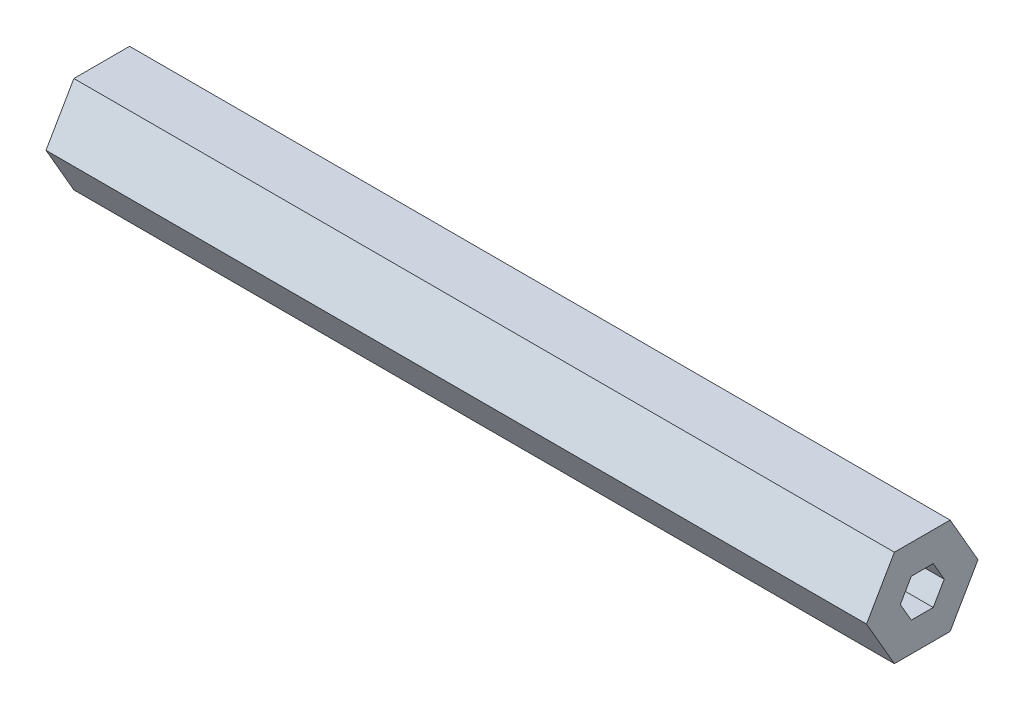
ISO-10303-21;
HEADER;
FILE_DESCRIPTION(('STEP AP214'),'2;1');
FILE_NAME('part.step','',(''),(''),'','','');
FILE_SCHEMA(('AUTOMOTIVE_DESIGN { 1 0 10303 214 1 1 1 1 }'));
ENDSEC;
DATA;
#1=APPLICATION_CONTEXT('core data for automotive mechanical design processes');
#2=APPLICATION_PROTOCOL_DEFINITION('international standard','automotive_design',2000,#1);
#3=PRODUCT_CONTEXT('',#1,'mechanical');
#4=PRODUCT('Part','Part','',(#3));
#5=PRODUCT_RELATED_PRODUCT_CATEGORY('part','',(#4));
#6=PRODUCT_DEFINITION_FORMATION('','',#4);
#7=PRODUCT_DEFINITION_CONTEXT('part definition',#1,'design');
#8=PRODUCT_DEFINITION('design','',#6,#7);
#9=PRODUCT_DEFINITION_SHAPE('','',#8);
#10=(LENGTH_UNIT() NAMED_UNIT(*) SI_UNIT(.MILLI.,.METRE.));
#11=(NAMED_UNIT(*) PLANE_ANGLE_UNIT() SI_UNIT($,.RADIAN.));
#12=(NAMED_UNIT(*) SI_UNIT($,.STERADIAN.) SOLID_ANGLE_UNIT());
#13=UNCERTAINTY_MEASURE_WITH_UNIT(LENGTH_MEASURE(1.E-05),#10,'distance_accuracy_value','');
#14=(GEOMETRIC_REPRESENTATION_CONTEXT(3) GLOBAL_UNCERTAINTY_ASSIGNED_CONTEXT((#13)) GLOBAL_UNIT_ASSIGNED_CONTEXT((#10,
#11,#12)) REPRESENTATION_CONTEXT('',''));
#15=CARTESIAN_POINT('',(0.,0.,0.));
#16=DIRECTION('',(0.,0.,1.));
#17=DIRECTION('',(1.,0.,0.));
#18=AXIS2_PLACEMENT_3D('',#15,#16,#17);
#19=CARTESIAN_POINT('',(107.95,0.,0.));
#20=DIRECTION('',(1.,0.,0.));
#21=DIRECTION('',(0.,0.,-1.));
#22=AXIS2_PLACEMENT_3D('',#19,#20,#21);
#23=PLANE('',#22);
#24=DIRECTION('',(0.,0.866025403784441,-0.499999999999995));
#25=VECTOR('',#24,1.);
#26=CARTESIAN_POINT('',(107.95,-6.34999999999996,-3.6661742093542));
#27=LINE('',#26,#25);
#28=CARTESIAN_POINT('',(107.95,-6.34999999999996,-3.6661742093542));
#29=VERTEX_POINT('',#28);
#30=CARTESIAN_POINT('',(107.95,0.,-7.33234841870825));
#31=VERTEX_POINT('',#30);
#32=EDGE_CURVE('E187',#29,#31,#27,.T.);
#33=ORIENTED_EDGE('',*,*,#32,.T.);
#34=DIRECTION('',(0.,0.866025403784438,0.500000000000001));
#35=VECTOR('',#34,1.);
#36=CARTESIAN_POINT('',(107.95,0.,-7.33234841870825));
#37=LINE('',#36,#35);
#38=CARTESIAN_POINT('',(107.95,6.35000000000001,-3.66617420935411));
#39=VERTEX_POINT('',#38);
#40=EDGE_CURVE('E190',#31,#39,#37,.T.);
#41=ORIENTED_EDGE('',*,*,#40,.T.);
#42=DIRECTION('',(0.,0.,1.));
#43=VECTOR('',#42,1.);
#44=CARTESIAN_POINT('',(107.95,6.35000000000001,-3.66617420935411));
#45=LINE('',#44,#43);
#46=CARTESIAN_POINT('',(107.95,6.34999999999999,3.66617420935416));
#47=VERTEX_POINT('',#46);
#48=EDGE_CURVE('E193',#39,#47,#45,.T.);
#49=ORIENTED_EDGE('',*,*,#48,.T.);
#50=DIRECTION('',(0.,-0.866025403784442,0.499999999999995));
#51=VECTOR('',#50,1.);
#52=CARTESIAN_POINT('',(107.95,6.34999999999999,3.66617420935416));
#53=LINE('',#52,#51);
#54=CARTESIAN_POINT('',(107.95,0.,7.33234841870825));
#55=VERTEX_POINT('',#54);
#56=EDGE_CURVE('E195',#47,#55,#53,.T.);
#57=ORIENTED_EDGE('',*,*,#56,.T.);
#58=DIRECTION('',(0.,-0.866025403784435,-0.500000000000007));
#59=VECTOR('',#58,1.);
#60=CARTESIAN_POINT('',(107.95,0.,7.33234841870825));
#61=LINE('',#60,#59);
#62=CARTESIAN_POINT('',(107.95,-6.35000000000004,3.66617420935407));
#63=VERTEX_POINT('',#62);
#64=EDGE_CURVE('E197',#55,#63,#61,.T.);
#65=ORIENTED_EDGE('',*,*,#64,.T.);
#66=DIRECTION('',(0.,0.,-1.));
#67=VECTOR('',#66,1.);
#68=CARTESIAN_POINT('',(107.95,-6.35000000000004,3.66617420935407));
#69=LINE('',#68,#67);
#70=EDGE_CURVE('E199',#63,#29,#69,.T.);
#71=ORIENTED_EDGE('',*,*,#70,.T.);
#72=EDGE_LOOP('',(#33,#41,#49,#57,#65,#71));
#73=FACE_BOUND('',#72,.T.);
#74=DIRECTION('',(0.,0.866025403784438,0.5));
#75=VECTOR('',#74,1.);
#76=CARTESIAN_POINT('',(107.95,0.,-2.88675134594813));
#77=LINE('',#76,#75);
#78=CARTESIAN_POINT('',(107.95,0.,-2.88675134594813));
#79=VERTEX_POINT('',#78);
#80=CARTESIAN_POINT('',(107.95,2.5,-1.44337567297406));
#81=VERTEX_POINT('',#80);
#82=EDGE_CURVE('E141',#79,#81,#77,.T.);
#83=ORIENTED_EDGE('',*,*,#82,.F.);
#84=DIRECTION('',(0.,0.866025403784439,-0.5));
#85=VECTOR('',#84,1.);
#86=CARTESIAN_POINT('',(107.95,-2.5,-1.44337567297407));
#87=LINE('',#86,#85);
#88=CARTESIAN_POINT('',(107.95,-2.5,-1.44337567297407));
#89=VERTEX_POINT('',#88);
#90=EDGE_CURVE('E133',#89,#79,#87,.T.);
#91=ORIENTED_EDGE('',*,*,#90,.F.);
#92=DIRECTION('',(0.,0.,-1.));
#93=VECTOR('',#92,1.);
#94=CARTESIAN_POINT('',(107.95,-2.5,1.44337567297406));
#95=LINE('',#94,#93);
#96=CARTESIAN_POINT('',(107.95,-2.5,1.44337567297406));
#97=VERTEX_POINT('',#96);
#98=EDGE_CURVE('E163',#97,#89,#95,.T.);
#99=ORIENTED_EDGE('',*,*,#98,.F.);
#100=DIRECTION('',(0.,-0.866025403784438,-0.5));
#101=VECTOR('',#100,1.);
#102=CARTESIAN_POINT('',(107.95,0.,2.88675134594813));
#103=LINE('',#102,#101);
#104=CARTESIAN_POINT('',(107.95,0.,2.88675134594813));
#105=VERTEX_POINT('',#104);
#106=EDGE_CURVE('E161',#105,#97,#103,.T.);
#107=ORIENTED_EDGE('',*,*,#106,.F.);
#108=DIRECTION('',(0.,-0.866025403784439,0.5));
#109=VECTOR('',#108,1.);
#110=CARTESIAN_POINT('',(107.95,2.5,1.44337567297406));
#111=LINE('',#110,#109);
#112=CARTESIAN_POINT('',(107.95,2.5,1.44337567297406));
#113=VERTEX_POINT('',#112);
#114=EDGE_CURVE('E157',#113,#105,#111,.T.);
#115=ORIENTED_EDGE('',*,*,#114,.F.);
#116=DIRECTION('',(0.,0.,1.));
#117=VECTOR('',#116,1.);
#118=CARTESIAN_POINT('',(107.95,2.5,-1.44337567297406));
#119=LINE('',#118,#117);
#120=EDGE_CURVE('E155',#81,#113,#119,.T.);
#121=ORIENTED_EDGE('',*,*,#120,.F.);
#122=EDGE_LOOP('',(#83,#91,#99,#107,#115,#121));
#123=FACE_BOUND('',#122,.T.);
#124=ADVANCED_FACE('F43',(#73,#123),#23,.T.);
#125=CARTESIAN_POINT('',(0.,0.,0.));
#126=DIRECTION('',(1.,0.,0.));
#127=DIRECTION('',(0.,0.,-1.));
#128=AXIS2_PLACEMENT_3D('',#125,#126,#127);
#129=PLANE('',#128);
#130=DIRECTION('',(0.,0.866025403784441,-0.499999999999995));
#131=VECTOR('',#130,1.);
#132=CARTESIAN_POINT('',(0.,-6.34999999999996,-3.6661742093542));
#133=LINE('',#132,#131);
#134=CARTESIAN_POINT('',(0.,-6.34999999999996,-3.6661742093542));
#135=VERTEX_POINT('',#134);
#136=CARTESIAN_POINT('',(0.,0.,-7.33234841870825));
#137=VERTEX_POINT('',#136);
#138=EDGE_CURVE('E150',#135,#137,#133,.T.);
#139=ORIENTED_EDGE('',*,*,#138,.F.);
#140=DIRECTION('',(0.,0.,-1.));
#141=VECTOR('',#140,1.);
#142=CARTESIAN_POINT('',(0.,-6.35000000000004,3.66617420935407));
#143=LINE('',#142,#141);
#144=CARTESIAN_POINT('',(0.,-6.35000000000004,3.66617420935407));
#145=VERTEX_POINT('',#144);
#146=EDGE_CURVE('E191',#145,#135,#143,.T.);
#147=ORIENTED_EDGE('',*,*,#146,.F.);
#148=DIRECTION('',(0.,-0.866025403784435,-0.500000000000007));
#149=VECTOR('',#148,1.);
#150=CARTESIAN_POINT('',(0.,0.,7.33234841870825));
#151=LINE('',#150,#149);
#152=CARTESIAN_POINT('',(0.,0.,7.33234841870825));
#153=VERTEX_POINT('',#152);
#154=EDGE_CURVE('E210',#153,#145,#151,.T.);
#155=ORIENTED_EDGE('',*,*,#154,.F.);
#156=DIRECTION('',(0.,-0.866025403784442,0.499999999999995));
#157=VECTOR('',#156,1.);
#158=CARTESIAN_POINT('',(0.,6.34999999999999,3.66617420935416));
#159=LINE('',#158,#157);
#160=CARTESIAN_POINT('',(0.,6.34999999999999,3.66617420935416));
#161=VERTEX_POINT('',#160);
#162=EDGE_CURVE('E208',#161,#153,#159,.T.);
#163=ORIENTED_EDGE('',*,*,#162,.F.);
#164=DIRECTION('',(0.,0.,1.));
#165=VECTOR('',#164,1.);
#166=CARTESIAN_POINT('',(0.,6.35000000000001,-3.66617420935411));
#167=LINE('',#166,#165);
#168=CARTESIAN_POINT('',(0.,6.35000000000001,-3.66617420935411));
#169=VERTEX_POINT('',#168);
#170=EDGE_CURVE('E206',#169,#161,#167,.T.);
#171=ORIENTED_EDGE('',*,*,#170,.F.);
#172=DIRECTION('',(0.,0.866025403784438,0.500000000000001));
#173=VECTOR('',#172,1.);
#174=CARTESIAN_POINT('',(0.,0.,-7.33234841870825));
#175=LINE('',#174,#173);
#176=EDGE_CURVE('E204',#137,#169,#175,.T.);
#177=ORIENTED_EDGE('',*,*,#176,.F.);
#178=EDGE_LOOP('',(#139,#147,#155,#163,#171,#177));
#179=FACE_BOUND('',#178,.T.);
#180=DIRECTION('',(0.,0.866025403784439,-0.5));
#181=VECTOR('',#180,1.);
#182=CARTESIAN_POINT('',(0.,-2.5,-1.44337567297407));
#183=LINE('',#182,#181);
#184=CARTESIAN_POINT('',(0.,-2.5,-1.44337567297407));
#185=VERTEX_POINT('',#184);
#186=CARTESIAN_POINT('',(0.,0.,-2.88675134594813));
#187=VERTEX_POINT('',#186);
#188=EDGE_CURVE('E67',#185,#187,#183,.T.);
#189=ORIENTED_EDGE('',*,*,#188,.T.);
#190=DIRECTION('',(0.,0.866025403784438,0.5));
#191=VECTOR('',#190,1.);
#192=CARTESIAN_POINT('',(0.,0.,-2.88675134594813));
#193=LINE('',#192,#191);
#194=CARTESIAN_POINT('',(0.,2.5,-1.44337567297406));
#195=VERTEX_POINT('',#194);
#196=EDGE_CURVE('E148',#187,#195,#193,.T.);
#197=ORIENTED_EDGE('',*,*,#196,.T.);
#198=DIRECTION('',(0.,0.,1.));
#199=VECTOR('',#198,1.);
#200=CARTESIAN_POINT('',(0.,2.5,-1.44337567297406));
#201=LINE('',#200,#199);
#202=CARTESIAN_POINT('',(0.,2.5,1.44337567297406));
#203=VERTEX_POINT('',#202);
#204=EDGE_CURVE('E167',#195,#203,#201,.T.);
#205=ORIENTED_EDGE('',*,*,#204,.T.);
#206=DIRECTION('',(0.,-0.866025403784439,0.5));
#207=VECTOR('',#206,1.);
#208=CARTESIAN_POINT('',(0.,2.5,1.44337567297406));
#209=LINE('',#208,#207);
#210=CARTESIAN_POINT('',(0.,0.,2.88675134594813));
#211=VERTEX_POINT('',#210);
#212=EDGE_CURVE('E170',#203,#211,#209,.T.);
#213=ORIENTED_EDGE('',*,*,#212,.T.);
#214=DIRECTION('',(0.,-0.866025403784438,-0.5));
#215=VECTOR('',#214,1.);
#216=CARTESIAN_POINT('',(0.,0.,2.88675134594813));
#217=LINE('',#216,#215);
#218=CARTESIAN_POINT('',(0.,-2.5,1.44337567297406));
#219=VERTEX_POINT('',#218);
#220=EDGE_CURVE('E173',#211,#219,#217,.T.);
#221=ORIENTED_EDGE('',*,*,#220,.T.);
#222=DIRECTION('',(0.,0.,-1.));
#223=VECTOR('',#222,1.);
#224=CARTESIAN_POINT('',(0.,-2.5,1.44337567297406));
#225=LINE('',#224,#223);
#226=EDGE_CURVE('E142',#219,#185,#225,.T.);
#227=ORIENTED_EDGE('',*,*,#226,.T.);
#228=EDGE_LOOP('',(#189,#197,#205,#213,#221,#227));
#229=FACE_BOUND('',#228,.T.);
#230=ADVANCED_FACE('F236',(#179,#229),#129,.F.);
#231=CARTESIAN_POINT('',(107.95,-6.34999999999996,-3.6661742093542));
#232=DIRECTION('',(0.,0.499999999999995,0.866025403784441));
#233=DIRECTION('',(0.,-0.866025403784441,0.499999999999995));
#234=AXIS2_PLACEMENT_3D('',#231,#232,#233);
#235=PLANE('',#234);
#236=ORIENTED_EDGE('',*,*,#138,.T.);
#237=DIRECTION('',(-1.,0.,0.));
#238=VECTOR('',#237,1.);
#239=CARTESIAN_POINT('',(107.95,0.,-7.33234841870825));
#240=LINE('',#239,#238);
#241=EDGE_CURVE('E11',#31,#137,#240,.T.);
#242=ORIENTED_EDGE('',*,*,#241,.F.);
#243=ORIENTED_EDGE('',*,*,#32,.F.);
#244=DIRECTION('',(-1.,0.,0.));
#245=VECTOR('',#244,1.);
#246=CARTESIAN_POINT('',(107.95,-6.34999999999996,-3.6661742093542));
#247=LINE('',#246,#245);
#248=EDGE_CURVE('E201',#29,#135,#247,.T.);
#249=ORIENTED_EDGE('',*,*,#248,.T.);
#250=EDGE_LOOP('',(#236,#242,#243,#249));
#251=FACE_BOUND('',#250,.T.);
#252=ADVANCED_FACE('F45',(#251),#235,.F.);
#253=CARTESIAN_POINT('',(107.95,0.,-7.33234841870825));
#254=DIRECTION('',(0.,-0.500000000000001,0.866025403784438));
#255=DIRECTION('',(0.,-0.866025403784438,-0.500000000000001));
#256=AXIS2_PLACEMENT_3D('',#253,#254,#255);
#257=PLANE('',#256);
#258=ORIENTED_EDGE('',*,*,#176,.T.);
#259=DIRECTION('',(-1.,0.,0.));
#260=VECTOR('',#259,1.);
#261=CARTESIAN_POINT('',(107.95,6.35000000000001,-3.66617420935411));
#262=LINE('',#261,#260);
#263=EDGE_CURVE('E52',#39,#169,#262,.T.);
#264=ORIENTED_EDGE('',*,*,#263,.F.);
#265=ORIENTED_EDGE('',*,*,#40,.F.);
#266=ORIENTED_EDGE('',*,*,#241,.T.);
#267=EDGE_LOOP('',(#258,#264,#265,#266));
#268=FACE_BOUND('',#267,.T.);
#269=ADVANCED_FACE('F253',(#268),#257,.F.);
#270=CARTESIAN_POINT('',(107.95,6.35000000000001,-3.66617420935411));
#271=DIRECTION('',(0.,-1.,0.));
#272=DIRECTION('',(0.,0.,-1.));
#273=AXIS2_PLACEMENT_3D('',#270,#271,#272);
#274=PLANE('',#273);
#275=ORIENTED_EDGE('',*,*,#170,.T.);
#276=DIRECTION('',(-1.,0.,0.));
#277=VECTOR('',#276,1.);
#278=CARTESIAN_POINT('',(107.95,6.34999999999999,3.66617420935416));
#279=LINE('',#278,#277);
#280=EDGE_CURVE('E221',#47,#161,#279,.T.);
#281=ORIENTED_EDGE('',*,*,#280,.F.);
#282=ORIENTED_EDGE('',*,*,#48,.F.);
#283=ORIENTED_EDGE('',*,*,#263,.T.);
#284=EDGE_LOOP('',(#275,#281,#282,#283));
#285=FACE_BOUND('',#284,.T.);
#286=ADVANCED_FACE('F230',(#285),#274,.F.);
#287=CARTESIAN_POINT('',(107.95,6.34999999999999,3.66617420935416));
#288=DIRECTION('',(0.,-0.499999999999995,-0.866025403784442));
#289=DIRECTION('',(0.,0.866025403784442,-0.499999999999995));
#290=AXIS2_PLACEMENT_3D('',#287,#288,#289);
#291=PLANE('',#290);
#292=ORIENTED_EDGE('',*,*,#162,.T.);
#293=DIRECTION('',(-1.,0.,0.));
#294=VECTOR('',#293,1.);
#295=CARTESIAN_POINT('',(107.95,0.,7.33234841870825));
#296=LINE('',#295,#294);
#297=EDGE_CURVE('E218',#55,#153,#296,.T.);
#298=ORIENTED_EDGE('',*,*,#297,.F.);
#299=ORIENTED_EDGE('',*,*,#56,.F.);
#300=ORIENTED_EDGE('',*,*,#280,.T.);
#301=EDGE_LOOP('',(#292,#298,#299,#300));
#302=FACE_BOUND('',#301,.T.);
#303=ADVANCED_FACE('F242',(#302),#291,.F.);
#304=CARTESIAN_POINT('',(107.95,0.,7.33234841870825));
#305=DIRECTION('',(0.,0.500000000000007,-0.866025403784435));
#306=DIRECTION('',(0.,0.866025403784435,0.500000000000007));
#307=AXIS2_PLACEMENT_3D('',#304,#305,#306);
#308=PLANE('',#307);
#309=ORIENTED_EDGE('',*,*,#154,.T.);
#310=DIRECTION('',(-1.,0.,0.));
#311=VECTOR('',#310,1.);
#312=CARTESIAN_POINT('',(107.95,-6.35000000000004,3.66617420935407));
#313=LINE('',#312,#311);
#314=EDGE_CURVE('E215',#63,#145,#313,.T.);
#315=ORIENTED_EDGE('',*,*,#314,.F.);
#316=ORIENTED_EDGE('',*,*,#64,.F.);
#317=ORIENTED_EDGE('',*,*,#297,.T.);
#318=EDGE_LOOP('',(#309,#315,#316,#317));
#319=FACE_BOUND('',#318,.T.);
#320=ADVANCED_FACE('F246',(#319),#308,.F.);
#321=CARTESIAN_POINT('',(107.95,-6.35000000000004,3.66617420935407));
#322=DIRECTION('',(0.,1.,0.));
#323=DIRECTION('',(0.,0.,1.));
#324=AXIS2_PLACEMENT_3D('',#321,#322,#323);
#325=PLANE('',#324);
#326=ORIENTED_EDGE('',*,*,#146,.T.);
#327=ORIENTED_EDGE('',*,*,#248,.F.);
#328=ORIENTED_EDGE('',*,*,#70,.F.);
#329=ORIENTED_EDGE('',*,*,#314,.T.);
#330=EDGE_LOOP('',(#326,#327,#328,#329));
#331=FACE_BOUND('',#330,.T.);
#332=ADVANCED_FACE('F256',(#331),#325,.F.);
#333=CARTESIAN_POINT('',(107.95,-2.5,-1.44337567297407));
#334=DIRECTION('',(0.,0.5,0.866025403784439));
#335=DIRECTION('',(0.,-0.866025403784439,0.5));
#336=AXIS2_PLACEMENT_3D('',#333,#334,#335);
#337=PLANE('',#336);
#338=ORIENTED_EDGE('',*,*,#188,.F.);
#339=DIRECTION('',(-1.,0.,0.));
#340=VECTOR('',#339,1.);
#341=CARTESIAN_POINT('',(107.95,-2.5,-1.44337567297407));
#342=LINE('',#341,#340);
#343=EDGE_CURVE('E137',#89,#185,#342,.T.);
#344=ORIENTED_EDGE('',*,*,#343,.F.);
#345=ORIENTED_EDGE('',*,*,#90,.T.);
#346=DIRECTION('',(-1.,0.,0.));
#347=VECTOR('',#346,1.);
#348=CARTESIAN_POINT('',(107.95,0.,-2.88675134594813));
#349=LINE('',#348,#347);
#350=EDGE_CURVE('E136',#79,#187,#349,.T.);
#351=ORIENTED_EDGE('',*,*,#350,.T.);
#352=EDGE_LOOP('',(#338,#344,#345,#351));
#353=FACE_BOUND('',#352,.T.);
#354=ADVANCED_FACE('F135',(#353),#337,.T.);
#355=CARTESIAN_POINT('',(107.95,0.,-2.88675134594813));
#356=DIRECTION('',(0.,-0.5,0.866025403784438));
#357=DIRECTION('',(0.,-0.866025403784439,-0.5));
#358=AXIS2_PLACEMENT_3D('',#355,#356,#357);
#359=PLANE('',#358);
#360=ORIENTED_EDGE('',*,*,#196,.F.);
#361=ORIENTED_EDGE('',*,*,#350,.F.);
#362=ORIENTED_EDGE('',*,*,#82,.T.);
#363=DIRECTION('',(-1.,0.,0.));
#364=VECTOR('',#363,1.);
#365=CARTESIAN_POINT('',(107.95,2.5,-1.44337567297406));
#366=LINE('',#365,#364);
#367=EDGE_CURVE('E151',#81,#195,#366,.T.);
#368=ORIENTED_EDGE('',*,*,#367,.T.);
#369=EDGE_LOOP('',(#360,#361,#362,#368));
#370=FACE_BOUND('',#369,.T.);
#371=ADVANCED_FACE('F145',(#370),#359,.T.);
#372=CARTESIAN_POINT('',(107.95,2.5,-1.44337567297406));
#373=DIRECTION('',(0.,-1.,0.));
#374=DIRECTION('',(0.,0.,-1.));
#375=AXIS2_PLACEMENT_3D('',#372,#373,#374);
#376=PLANE('',#375);
#377=ORIENTED_EDGE('',*,*,#204,.F.);
#378=ORIENTED_EDGE('',*,*,#367,.F.);
#379=ORIENTED_EDGE('',*,*,#120,.T.);
#380=DIRECTION('',(-1.,0.,0.));
#381=VECTOR('',#380,1.);
#382=CARTESIAN_POINT('',(107.95,2.5,1.44337567297406));
#383=LINE('',#382,#381);
#384=EDGE_CURVE('E182',#113,#203,#383,.T.);
#385=ORIENTED_EDGE('',*,*,#384,.T.);
#386=EDGE_LOOP('',(#377,#378,#379,#385));
#387=FACE_BOUND('',#386,.T.);
#388=ADVANCED_FACE('F274',(#387),#376,.T.);
#389=CARTESIAN_POINT('',(107.95,2.5,1.44337567297406));
#390=DIRECTION('',(0.,-0.5,-0.866025403784439));
#391=DIRECTION('',(0.,0.866025403784439,-0.5));
#392=AXIS2_PLACEMENT_3D('',#389,#390,#391);
#393=PLANE('',#392);
#394=ORIENTED_EDGE('',*,*,#212,.F.);
#395=ORIENTED_EDGE('',*,*,#384,.F.);
#396=ORIENTED_EDGE('',*,*,#114,.T.);
#397=DIRECTION('',(-1.,0.,0.));
#398=VECTOR('',#397,1.);
#399=CARTESIAN_POINT('',(107.95,0.,2.88675134594813));
#400=LINE('',#399,#398);
#401=EDGE_CURVE('E180',#105,#211,#400,.T.);
#402=ORIENTED_EDGE('',*,*,#401,.T.);
#403=EDGE_LOOP('',(#394,#395,#396,#402));
#404=FACE_BOUND('',#403,.T.);
#405=ADVANCED_FACE('F277',(#404),#393,.T.);
#406=CARTESIAN_POINT('',(107.95,0.,2.88675134594813));
#407=DIRECTION('',(0.,0.5,-0.866025403784438));
#408=DIRECTION('',(0.,0.866025403784438,0.5));
#409=AXIS2_PLACEMENT_3D('',#406,#407,#408);
#410=PLANE('',#409);
#411=ORIENTED_EDGE('',*,*,#220,.F.);
#412=ORIENTED_EDGE('',*,*,#401,.F.);
#413=ORIENTED_EDGE('',*,*,#106,.T.);
#414=DIRECTION('',(-1.,0.,0.));
#415=VECTOR('',#414,1.);
#416=CARTESIAN_POINT('',(107.95,-2.5,1.44337567297406));
#417=LINE('',#416,#415);
#418=EDGE_CURVE('E59',#97,#219,#417,.T.);
#419=ORIENTED_EDGE('',*,*,#418,.T.);
#420=EDGE_LOOP('',(#411,#412,#413,#419));
#421=FACE_BOUND('',#420,.T.);
#422=ADVANCED_FACE('F281',(#421),#410,.T.);
#423=CARTESIAN_POINT('',(107.95,-2.5,1.44337567297406));
#424=DIRECTION('',(0.,1.,0.));
#425=DIRECTION('',(0.,0.,1.));
#426=AXIS2_PLACEMENT_3D('',#423,#424,#425);
#427=PLANE('',#426);
#428=ORIENTED_EDGE('',*,*,#226,.F.);
#429=ORIENTED_EDGE('',*,*,#418,.F.);
#430=ORIENTED_EDGE('',*,*,#98,.T.);
#431=ORIENTED_EDGE('',*,*,#343,.T.);
#432=EDGE_LOOP('',(#428,#429,#430,#431));
#433=FACE_BOUND('',#432,.T.);
#434=ADVANCED_FACE('F285',(#433),#427,.T.);
#435=CLOSED_SHELL('',(#124,#230,#252,#269,#286,#303,#320,#332,#354,#371,#388,#405,#422,#434));
#436=MANIFOLD_SOLID_BREP('B2',#435);
#437=ADVANCED_BREP_SHAPE_REPRESENTATION('',(#18,#436),#14);
#438=SHAPE_DEFINITION_REPRESENTATION(#9,#437);
ENDSEC;
END-ISO-10303-21;
